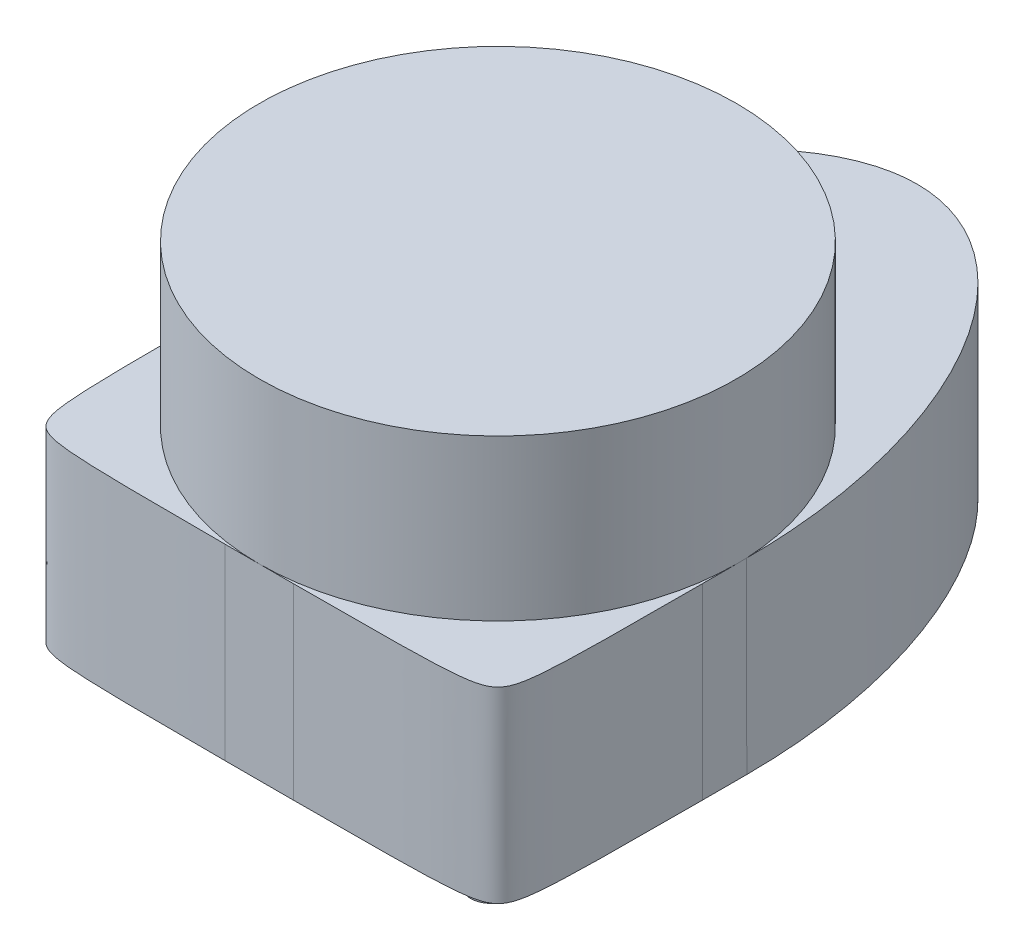
ISO-10303-21;
HEADER;
FILE_DESCRIPTION(('STEP AP214'),'2;1');
FILE_NAME('part.step','',(''),(''),'','','');
FILE_SCHEMA(('AUTOMOTIVE_DESIGN { 1 0 10303 214 1 1 1 1 }'));
ENDSEC;
DATA;
#1=APPLICATION_CONTEXT('core data for automotive mechanical design processes');
#2=APPLICATION_PROTOCOL_DEFINITION('international standard','automotive_design',2000,#1);
#3=PRODUCT_CONTEXT('',#1,'mechanical');
#4=PRODUCT('Part','Part','',(#3));
#5=PRODUCT_RELATED_PRODUCT_CATEGORY('part','',(#4));
#6=PRODUCT_DEFINITION_FORMATION('','',#4);
#7=PRODUCT_DEFINITION_CONTEXT('part definition',#1,'design');
#8=PRODUCT_DEFINITION('design','',#6,#7);
#9=PRODUCT_DEFINITION_SHAPE('','',#8);
#10=(LENGTH_UNIT() NAMED_UNIT(*) SI_UNIT(.MILLI.,.METRE.));
#11=(NAMED_UNIT(*) PLANE_ANGLE_UNIT() SI_UNIT($,.RADIAN.));
#12=(NAMED_UNIT(*) SI_UNIT($,.STERADIAN.) SOLID_ANGLE_UNIT());
#13=UNCERTAINTY_MEASURE_WITH_UNIT(LENGTH_MEASURE(1.E-05),#10,'distance_accuracy_value','');
#14=(GEOMETRIC_REPRESENTATION_CONTEXT(3) GLOBAL_UNCERTAINTY_ASSIGNED_CONTEXT((#13)) GLOBAL_UNIT_ASSIGNED_CONTEXT((#10,
#11,#12)) REPRESENTATION_CONTEXT('',''));
#15=CARTESIAN_POINT('',(0.,0.,0.));
#16=DIRECTION('',(0.,0.,1.));
#17=DIRECTION('',(1.,0.,0.));
#18=AXIS2_PLACEMENT_3D('',#15,#16,#17);
#19=CARTESIAN_POINT('',(35.,2.75,5.00000000000001));
#20=CARTESIAN_POINT('',(35.,-8.25000000000002,5.00000000000001));
#21=CARTESIAN_POINT('',(35.,-19.25,5.00000000000001));
#22=CARTESIAN_POINT('',(35.,-30.25,5.00000000000001));
#23=CARTESIAN_POINT('',(35.,2.75,35.));
#24=CARTESIAN_POINT('',(35.,-8.25,35.));
#25=CARTESIAN_POINT('',(35.,-19.25,35.));
#26=CARTESIAN_POINT('',(35.,-30.25,35.));
#27=CARTESIAN_POINT('',(5.00000000000001,2.75,35.));
#28=CARTESIAN_POINT('',(5.00000000000001,-8.25000000000002,35.));
#29=CARTESIAN_POINT('',(5.00000000000001,-19.25,35.));
#30=CARTESIAN_POINT('',(5.00000000000001,-30.25,35.));
#31=(BOUNDED_SURFACE() B_SPLINE_SURFACE(2,3,((#19,#20,#21,#22),(#23,#24,#25,#26),(#27,#28,#29,
#30)),.UNSPECIFIED.,.F.,.F.,.F.) B_SPLINE_SURFACE_WITH_KNOTS((3,3),(4,4),(0.,1.),(-0.03025,
0.00275),.UNSPECIFIED.) GEOMETRIC_REPRESENTATION_ITEM() RATIONAL_B_SPLINE_SURFACE(((1.,1.,1.,
1.),(7.07106781186548,7.07106781186548,7.07106781186548,7.07106781186548),(1.,1.,1.,1.))) REPRESENTATION_ITEM('') SURFACE());
#32=CARTESIAN_POINT('',(35.,-30.25,5.00000000000001));
#33=CARTESIAN_POINT('',(35.,-19.25,5.00000000000001));
#34=CARTESIAN_POINT('',(35.,-8.25000000000002,5.00000000000001));
#35=CARTESIAN_POINT('',(35.,2.75,5.00000000000001));
#36=(BOUNDED_CURVE() B_SPLINE_CURVE(3,(#32,#33,#34,#35),.UNSPECIFIED.,.F.,
.F.) B_SPLINE_CURVE_WITH_KNOTS((4,4),(-0.03025,0.00275),
.UNSPECIFIED.) CURVE() GEOMETRIC_REPRESENTATION_ITEM() RATIONAL_B_SPLINE_CURVE((1.,1.,1.,1.)) REPRESENTATION_ITEM(''));
#37=CARTESIAN_POINT('',(35.,0.,5.00000000000001));
#38=VERTEX_POINT('',#37);
#39=CARTESIAN_POINT('',(35.,-27.5,5.00000000000001));
#40=VERTEX_POINT('',#39);
#41=EDGE_CURVE('E488',#38,#40,#36,.F.);
#42=CARTESIAN_POINT('',(35.,0.,5.00000000000001));
#43=CARTESIAN_POINT('',(35.,0.,35.));
#44=CARTESIAN_POINT('',(5.00000000000001,0.,35.));
#45=(BOUNDED_CURVE() B_SPLINE_CURVE(2,(#42,#43,#44),.UNSPECIFIED.,.F.,
.F.) B_SPLINE_CURVE_WITH_KNOTS((3,3),(0.,1.),
.UNSPECIFIED.) CURVE() GEOMETRIC_REPRESENTATION_ITEM() RATIONAL_B_SPLINE_CURVE((1.,
7.07106781186548,1.)) REPRESENTATION_ITEM(''));
#46=CARTESIAN_POINT('',(5.00000000000001,0.,35.));
#47=VERTEX_POINT('',#46);
#48=EDGE_CURVE('E51',#47,#38,#45,.F.);
#49=CARTESIAN_POINT('',(5.00000000000001,2.75,35.));
#50=CARTESIAN_POINT('',(5.00000000000001,-8.25000000000002,35.));
#51=CARTESIAN_POINT('',(5.00000000000001,-19.25,35.));
#52=CARTESIAN_POINT('',(5.00000000000001,-30.25,35.));
#53=(BOUNDED_CURVE() B_SPLINE_CURVE(3,(#49,#50,#51,#52),.UNSPECIFIED.,.F.,
.F.) B_SPLINE_CURVE_WITH_KNOTS((4,4),(-0.03025,0.00275),
.UNSPECIFIED.) CURVE() GEOMETRIC_REPRESENTATION_ITEM() RATIONAL_B_SPLINE_CURVE((1.,1.,1.,1.)) REPRESENTATION_ITEM(''));
#54=CARTESIAN_POINT('',(5.00000000000001,-27.5,35.));
#55=VERTEX_POINT('',#54);
#56=EDGE_CURVE('E494',#55,#47,#53,.F.);
#57=CARTESIAN_POINT('',(5.00000000000001,-27.5,35.));
#58=CARTESIAN_POINT('',(35.,-27.5,35.));
#59=CARTESIAN_POINT('',(35.,-27.5,5.00000000000001));
#60=(BOUNDED_CURVE() B_SPLINE_CURVE(2,(#57,#58,#59),.UNSPECIFIED.,.F.,
.F.) B_SPLINE_CURVE_WITH_KNOTS((3,3),(0.,1.),
.UNSPECIFIED.) CURVE() GEOMETRIC_REPRESENTATION_ITEM() RATIONAL_B_SPLINE_CURVE((1.,
7.07106781186548,1.)) REPRESENTATION_ITEM(''));
#61=EDGE_CURVE('E12',#40,#55,#60,.F.);
#62=ORIENTED_EDGE('',*,*,#41,.F.);
#63=ORIENTED_EDGE('',*,*,#48,.F.);
#64=ORIENTED_EDGE('',*,*,#56,.F.);
#65=ORIENTED_EDGE('',*,*,#61,.F.);
#66=EDGE_LOOP('',(#62,#63,#64,#65));
#67=FACE_BOUND('',#66,.T.);
#68=ADVANCED_FACE('F38',(#67),#31,.T.);
#69=CARTESIAN_POINT('',(-35.,-30.25,5.));
#70=CARTESIAN_POINT('',(-35.,-19.25,5.));
#71=CARTESIAN_POINT('',(-35.,-8.25000000000001,5.));
#72=CARTESIAN_POINT('',(-35.,2.75,5.));
#73=CARTESIAN_POINT('',(-35.,-30.25,35.));
#74=CARTESIAN_POINT('',(-35.,-19.25,35.));
#75=CARTESIAN_POINT('',(-35.,-8.25000000000001,35.));
#76=CARTESIAN_POINT('',(-35.,2.75,35.));
#77=CARTESIAN_POINT('',(-5.,-30.25,35.));
#78=CARTESIAN_POINT('',(-5.,-19.25,35.));
#79=CARTESIAN_POINT('',(-5.,-8.25000000000001,35.));
#80=CARTESIAN_POINT('',(-5.,2.75,35.));
#81=(BOUNDED_SURFACE() B_SPLINE_SURFACE(2,3,((#69,#70,#71,#72),(#73,#74,#75,#76),(#77,#78,#79,
#80)),.UNSPECIFIED.,.F.,.F.,.F.) B_SPLINE_SURFACE_WITH_KNOTS((3,3),(4,4),(0.,1.),(-0.00275,
0.03025),.UNSPECIFIED.) GEOMETRIC_REPRESENTATION_ITEM() RATIONAL_B_SPLINE_SURFACE(((1.,1.,1.,
1.),(7.07106781186547,7.07106781186547,7.07106781186547,7.07106781186547),(1.,1.,1.,1.))) REPRESENTATION_ITEM('') SURFACE());
#82=CARTESIAN_POINT('',(-35.,2.75,5.));
#83=CARTESIAN_POINT('',(-35.,-8.25000000000001,5.));
#84=CARTESIAN_POINT('',(-35.,-19.25,5.));
#85=CARTESIAN_POINT('',(-35.,-30.25,5.));
#86=(BOUNDED_CURVE() B_SPLINE_CURVE(3,(#82,#83,#84,#85),.UNSPECIFIED.,.F.,
.F.) B_SPLINE_CURVE_WITH_KNOTS((4,4),(-0.00275,0.03025),
.UNSPECIFIED.) CURVE() GEOMETRIC_REPRESENTATION_ITEM() RATIONAL_B_SPLINE_CURVE((1.,1.,1.,1.)) REPRESENTATION_ITEM(''));
#87=CARTESIAN_POINT('',(-35.,-27.5,5.));
#88=VERTEX_POINT('',#87);
#89=CARTESIAN_POINT('',(-35.,0.,5.));
#90=VERTEX_POINT('',#89);
#91=EDGE_CURVE('E120',#88,#90,#86,.F.);
#92=CARTESIAN_POINT('',(-35.,-27.5,5.));
#93=CARTESIAN_POINT('',(-35.,-27.5,35.));
#94=CARTESIAN_POINT('',(-5.,-27.5,35.));
#95=(BOUNDED_CURVE() B_SPLINE_CURVE(2,(#92,#93,#94),.UNSPECIFIED.,.F.,
.F.) B_SPLINE_CURVE_WITH_KNOTS((3,3),(0.,1.),
.UNSPECIFIED.) CURVE() GEOMETRIC_REPRESENTATION_ITEM() RATIONAL_B_SPLINE_CURVE((1.,
7.07106781186547,1.)) REPRESENTATION_ITEM(''));
#96=CARTESIAN_POINT('',(-5.,-27.5,35.));
#97=VERTEX_POINT('',#96);
#98=EDGE_CURVE('E573',#97,#88,#95,.F.);
#99=CARTESIAN_POINT('',(-5.,-30.25,35.));
#100=CARTESIAN_POINT('',(-5.,-19.25,35.));
#101=CARTESIAN_POINT('',(-5.,-8.25000000000001,35.));
#102=CARTESIAN_POINT('',(-5.,2.75,35.));
#103=(BOUNDED_CURVE() B_SPLINE_CURVE(3,(#99,#100,#101,#102),.UNSPECIFIED.,.F.,
.F.) B_SPLINE_CURVE_WITH_KNOTS((4,4),(-0.00275,0.03025),
.UNSPECIFIED.) CURVE() GEOMETRIC_REPRESENTATION_ITEM() RATIONAL_B_SPLINE_CURVE((1.,1.,1.,1.)) REPRESENTATION_ITEM(''));
#104=CARTESIAN_POINT('',(-5.,0.,35.));
#105=VERTEX_POINT('',#104);
#106=EDGE_CURVE('E576',#105,#97,#103,.F.);
#107=CARTESIAN_POINT('',(-5.,0.,35.));
#108=CARTESIAN_POINT('',(-35.,0.,35.));
#109=CARTESIAN_POINT('',(-35.,0.,5.));
#110=(BOUNDED_CURVE() B_SPLINE_CURVE(2,(#107,#108,#109),.UNSPECIFIED.,.F.,
.F.) B_SPLINE_CURVE_WITH_KNOTS((3,3),(0.,1.),
.UNSPECIFIED.) CURVE() GEOMETRIC_REPRESENTATION_ITEM() RATIONAL_B_SPLINE_CURVE((1.,
7.07106781186548,1.)) REPRESENTATION_ITEM(''));
#111=EDGE_CURVE('E248',#90,#105,#110,.F.);
#112=ORIENTED_EDGE('',*,*,#91,.F.);
#113=ORIENTED_EDGE('',*,*,#98,.F.);
#114=ORIENTED_EDGE('',*,*,#106,.F.);
#115=ORIENTED_EDGE('',*,*,#111,.F.);
#116=EDGE_LOOP('',(#112,#113,#114,#115));
#117=FACE_BOUND('',#116,.T.);
#118=ADVANCED_FACE('F266',(#117),#81,.T.);
#119=CARTESIAN_POINT('',(0.,0.,0.));
#120=DIRECTION('',(0.,-1.,0.));
#121=DIRECTION('',(0.,0.,-1.));
#122=AXIS2_PLACEMENT_3D('',#119,#120,#121);
#123=PLANE('',#122);
#124=DIRECTION('',(0.,0.,1.));
#125=VECTOR('',#124,1.);
#126=CARTESIAN_POINT('',(35.,0.,35.));
#127=LINE('',#126,#125);
#128=CARTESIAN_POINT('',(34.9839506768092,0.,-1.49931217186325));
#129=VERTEX_POINT('',#128);
#130=CARTESIAN_POINT('',(35.,0.,0.));
#131=VERTEX_POINT('',#130);
#132=EDGE_CURVE('E414',#129,#131,#127,.T.);
#133=ORIENTED_EDGE('',*,*,#132,.F.);
#134=CARTESIAN_POINT('',(0.,0.,0.));
#135=DIRECTION('',(0.,1.,0.));
#136=DIRECTION('',(0.,0.,1.));
#137=AXIS2_PLACEMENT_3D('',#134,#135,#136);
#138=CIRCLE('',#137,35.);
#139=EDGE_CURVE('E156',#131,#129,#138,.T.);
#140=ORIENTED_EDGE('',*,*,#139,.F.);
#141=EDGE_LOOP('',(#133,#140));
#142=FACE_BOUND('',#141,.T.);
#143=ADVANCED_FACE('F280',(#142),#123,.F.);
#144=CARTESIAN_POINT('',(-34.9839506768092,0.,-1.49931217186326));
#145=VERTEX_POINT('',#144);
#146=CARTESIAN_POINT('',(-35.,0.,0.));
#147=VERTEX_POINT('',#146);
#148=EDGE_CURVE('E129',#145,#147,#138,.T.);
#149=ORIENTED_EDGE('',*,*,#148,.F.);
#150=DIRECTION('',(0.,0.,-1.));
#151=VECTOR('',#150,1.);
#152=CARTESIAN_POINT('',(-35.,0.,35.));
#153=LINE('',#152,#151);
#154=EDGE_CURVE('E117',#147,#145,#153,.T.);
#155=ORIENTED_EDGE('',*,*,#154,.F.);
#156=EDGE_LOOP('',(#149,#155));
#157=FACE_BOUND('',#156,.T.);
#158=ADVANCED_FACE('F147',(#157),#123,.F.);
#159=CARTESIAN_POINT('',(0.,23.5,0.));
#160=DIRECTION('',(0.,-1.,0.));
#161=DIRECTION('',(0.,0.,-1.));
#162=AXIS2_PLACEMENT_3D('',#159,#160,#161);
#163=CYLINDRICAL_SURFACE('',#162,35.);
#164=CARTESIAN_POINT('',(0.,23.5,0.));
#165=DIRECTION('',(0.,1.,0.));
#166=DIRECTION('',(0.,0.,1.));
#167=AXIS2_PLACEMENT_3D('',#164,#165,#166);
#168=CIRCLE('',#167,35.);
#169=CARTESIAN_POINT('',(0.,23.5,35.));
#170=VERTEX_POINT('',#169);
#171=EDGE_CURVE('E515',#170,#170,#168,.T.);
#172=ORIENTED_EDGE('',*,*,#171,.F.);
#173=EDGE_LOOP('',(#172));
#174=FACE_BOUND('',#173,.T.);
#175=CARTESIAN_POINT('',(0.,0.,35.));
#176=VERTEX_POINT('',#175);
#177=EDGE_CURVE('E146',#176,#131,#138,.T.);
#178=ORIENTED_EDGE('',*,*,#177,.T.);
#179=ORIENTED_EDGE('',*,*,#139,.T.);
#180=EDGE_CURVE('E135',#129,#145,#138,.T.);
#181=ORIENTED_EDGE('',*,*,#180,.T.);
#182=ORIENTED_EDGE('',*,*,#148,.T.);
#183=EDGE_CURVE('E132',#147,#176,#138,.T.);
#184=ORIENTED_EDGE('',*,*,#183,.T.);
#185=EDGE_LOOP('',(#178,#179,#181,#182,#184));
#186=FACE_BOUND('',#185,.T.);
#187=ADVANCED_FACE('F131',(#174,#186),#163,.T.);
#188=CARTESIAN_POINT('',(0.,23.5,0.));
#189=DIRECTION('',(0.,1.,0.));
#190=DIRECTION('',(0.,0.,1.));
#191=AXIS2_PLACEMENT_3D('',#188,#189,#190);
#192=PLANE('',#191);
#193=ORIENTED_EDGE('',*,*,#171,.T.);
#194=EDGE_LOOP('',(#193));
#195=FACE_BOUND('',#194,.T.);
#196=ADVANCED_FACE('F189',(#195),#192,.T.);
#197=DIRECTION('',(-1.,0.,0.));
#198=VECTOR('',#197,1.);
#199=CARTESIAN_POINT('',(-35.,0.,35.));
#200=LINE('',#199,#198);
#201=EDGE_CURVE('E510',#47,#176,#200,.T.);
#202=ORIENTED_EDGE('',*,*,#201,.F.);
#203=ORIENTED_EDGE('',*,*,#48,.T.);
#204=EDGE_CURVE('E124',#131,#38,#127,.T.);
#205=ORIENTED_EDGE('',*,*,#204,.F.);
#206=ORIENTED_EDGE('',*,*,#177,.F.);
#207=EDGE_LOOP('',(#202,#203,#205,#206));
#208=FACE_BOUND('',#207,.T.);
#209=ADVANCED_FACE('F612',(#208),#123,.F.);
#210=ORIENTED_EDGE('',*,*,#180,.F.);
#211=CARTESIAN_POINT('',(0.,0.,-61.5));
#212=CARTESIAN_POINT('',(35.,0.,-61.5));
#213=CARTESIAN_POINT('',(35.,0.,-1.5));
#214=(BOUNDED_CURVE() B_SPLINE_CURVE(2,(#211,#212,#213),.UNSPECIFIED.,.F.,
.F.) B_SPLINE_CURVE_WITH_KNOTS((3,3),(0.,1.),
.UNSPECIFIED.) CURVE() GEOMETRIC_REPRESENTATION_ITEM() RATIONAL_B_SPLINE_CURVE((1.,
0.666666666666667,1.)) REPRESENTATION_ITEM(''));
#215=CARTESIAN_POINT('',(0.,0.,-61.5));
#216=VERTEX_POINT('',#215);
#217=EDGE_CURVE('E528',#129,#216,#214,.F.);
#218=ORIENTED_EDGE('',*,*,#217,.T.);
#219=CARTESIAN_POINT('',(-35.,0.,-1.5));
#220=CARTESIAN_POINT('',(-35.,0.,-61.5));
#221=CARTESIAN_POINT('',(0.,0.,-61.5));
#222=(BOUNDED_CURVE() B_SPLINE_CURVE(2,(#219,#220,#221),.UNSPECIFIED.,.F.,
.F.) B_SPLINE_CURVE_WITH_KNOTS((3,3),(0.,1.),
.UNSPECIFIED.) CURVE() GEOMETRIC_REPRESENTATION_ITEM() RATIONAL_B_SPLINE_CURVE((1.,
0.666666666666667,1.)) REPRESENTATION_ITEM(''));
#223=EDGE_CURVE('E571',#216,#145,#222,.F.);
#224=ORIENTED_EDGE('',*,*,#223,.T.);
#225=EDGE_LOOP('',(#210,#218,#224));
#226=FACE_BOUND('',#225,.T.);
#227=ADVANCED_FACE('F186',(#226),#123,.F.);
#228=CARTESIAN_POINT('',(-35.,-27.5,35.));
#229=DIRECTION('',(1.,0.,0.));
#230=DIRECTION('',(0.,0.,-1.));
#231=AXIS2_PLACEMENT_3D('',#228,#229,#230);
#232=PLANE('',#231);
#233=DIRECTION('',(0.,0.,-1.));
#234=VECTOR('',#233,1.);
#235=CARTESIAN_POINT('',(-35.,-27.5,35.));
#236=LINE('',#235,#234);
#237=CARTESIAN_POINT('',(-35.,-27.5,-1.5));
#238=VERTEX_POINT('',#237);
#239=EDGE_CURVE('E167',#88,#238,#236,.T.);
#240=ORIENTED_EDGE('',*,*,#239,.F.);
#241=ORIENTED_EDGE('',*,*,#91,.T.);
#242=EDGE_CURVE('E111',#90,#147,#153,.T.);
#243=ORIENTED_EDGE('',*,*,#242,.T.);
#244=ORIENTED_EDGE('',*,*,#154,.T.);
#245=CARTESIAN_POINT('',(-35.,-28.875,-1.5));
#246=CARTESIAN_POINT('',(-35.,-18.7916666666667,-1.5));
#247=CARTESIAN_POINT('',(-35.,-8.70833333333334,-1.5));
#248=CARTESIAN_POINT('',(-35.,1.375,-1.5));
#249=(BOUNDED_CURVE() B_SPLINE_CURVE(3,(#245,#246,#247,#248),.UNSPECIFIED.,.F.,
.F.) B_SPLINE_CURVE_WITH_KNOTS((4,4),(-0.001375,0.028875),
.UNSPECIFIED.) CURVE() GEOMETRIC_REPRESENTATION_ITEM() RATIONAL_B_SPLINE_CURVE((1.,1.,1.,1.)) REPRESENTATION_ITEM(''));
#250=EDGE_CURVE('E572',#145,#238,#249,.F.);
#251=ORIENTED_EDGE('',*,*,#250,.T.);
#252=EDGE_LOOP('',(#240,#241,#243,#244,#251));
#253=FACE_BOUND('',#252,.T.);
#254=ADVANCED_FACE('F114',(#253),#232,.F.);
#255=CARTESIAN_POINT('',(35.,-27.5,35.));
#256=DIRECTION('',(-1.,0.,0.));
#257=DIRECTION('',(0.,0.,1.));
#258=AXIS2_PLACEMENT_3D('',#255,#256,#257);
#259=PLANE('',#258);
#260=ORIENTED_EDGE('',*,*,#204,.T.);
#261=ORIENTED_EDGE('',*,*,#41,.T.);
#262=DIRECTION('',(0.,0.,1.));
#263=VECTOR('',#262,1.);
#264=CARTESIAN_POINT('',(35.,-27.5,35.));
#265=LINE('',#264,#263);
#266=CARTESIAN_POINT('',(35.,-27.5,-1.49999999999999));
#267=VERTEX_POINT('',#266);
#268=EDGE_CURVE('E421',#267,#40,#265,.T.);
#269=ORIENTED_EDGE('',*,*,#268,.F.);
#270=CARTESIAN_POINT('',(35.,1.375,-1.5));
#271=CARTESIAN_POINT('',(35.,-8.70833333333334,-1.5));
#272=CARTESIAN_POINT('',(35.,-18.7916666666667,-1.5));
#273=CARTESIAN_POINT('',(35.,-28.875,-1.5));
#274=(BOUNDED_CURVE() B_SPLINE_CURVE(3,(#270,#271,#272,#273),.UNSPECIFIED.,.F.,
.F.) B_SPLINE_CURVE_WITH_KNOTS((4,4),(-0.001375,0.028875),
.UNSPECIFIED.) CURVE() GEOMETRIC_REPRESENTATION_ITEM() RATIONAL_B_SPLINE_CURVE((1.,1.,1.,1.)) REPRESENTATION_ITEM(''));
#275=EDGE_CURVE('E542',#267,#129,#274,.F.);
#276=ORIENTED_EDGE('',*,*,#275,.T.);
#277=ORIENTED_EDGE('',*,*,#132,.T.);
#278=EDGE_LOOP('',(#260,#261,#269,#276,#277));
#279=FACE_BOUND('',#278,.T.);
#280=ADVANCED_FACE('F185',(#279),#259,.F.);
#281=CARTESIAN_POINT('',(-35.,-27.5,35.));
#282=DIRECTION('',(0.,0.,-1.));
#283=DIRECTION('',(-1.,0.,0.));
#284=AXIS2_PLACEMENT_3D('',#281,#282,#283);
#285=PLANE('',#284);
#286=DIRECTION('',(-1.,0.,0.));
#287=VECTOR('',#286,1.);
#288=CARTESIAN_POINT('',(-35.,-27.5,35.));
#289=LINE('',#288,#287);
#290=EDGE_CURVE('E144',#55,#97,#289,.T.);
#291=ORIENTED_EDGE('',*,*,#290,.F.);
#292=ORIENTED_EDGE('',*,*,#56,.T.);
#293=ORIENTED_EDGE('',*,*,#201,.T.);
#294=EDGE_CURVE('E142',#176,#105,#200,.T.);
#295=ORIENTED_EDGE('',*,*,#294,.T.);
#296=ORIENTED_EDGE('',*,*,#106,.T.);
#297=EDGE_LOOP('',(#291,#292,#293,#295,#296));
#298=FACE_BOUND('',#297,.T.);
#299=ADVANCED_FACE('F222',(#298),#285,.F.);
#300=CARTESIAN_POINT('',(0.,-27.5,0.));
#301=DIRECTION('',(0.,-1.,0.));
#302=DIRECTION('',(0.,0.,-1.));
#303=AXIS2_PLACEMENT_3D('',#300,#301,#302);
#304=PLANE('',#303);
#305=CARTESIAN_POINT('',(-19.,-27.5,-42.5));
#306=DIRECTION('',(0.,-1.,0.));
#307=DIRECTION('',(0.,0.,-1.));
#308=AXIS2_PLACEMENT_3D('',#305,#306,#307);
#309=CIRCLE('',#308,3.);
#310=CARTESIAN_POINT('',(-19.,-27.5,-45.5));
#311=VERTEX_POINT('',#310);
#312=EDGE_CURVE('E443',#311,#311,#309,.T.);
#313=ORIENTED_EDGE('',*,*,#312,.F.);
#314=EDGE_LOOP('',(#313));
#315=FACE_BOUND('',#314,.T.);
#316=CARTESIAN_POINT('',(19.,-27.5,-42.5));
#317=DIRECTION('',(0.,-1.,0.));
#318=DIRECTION('',(0.,0.,-1.));
#319=AXIS2_PLACEMENT_3D('',#316,#317,#318);
#320=CIRCLE('',#319,3.);
#321=CARTESIAN_POINT('',(19.,-27.5,-45.5));
#322=VERTEX_POINT('',#321);
#323=EDGE_CURVE('E437',#322,#322,#320,.T.);
#324=ORIENTED_EDGE('',*,*,#323,.F.);
#325=EDGE_LOOP('',(#324));
#326=FACE_BOUND('',#325,.T.);
#327=CARTESIAN_POINT('',(27.,-27.5,28.));
#328=DIRECTION('',(0.,-1.,0.));
#329=DIRECTION('',(0.,0.,-1.));
#330=AXIS2_PLACEMENT_3D('',#327,#328,#329);
#331=CIRCLE('',#330,2.99999999999999);
#332=CARTESIAN_POINT('',(27.,-27.5,25.));
#333=VERTEX_POINT('',#332);
#334=EDGE_CURVE('E431',#333,#333,#331,.T.);
#335=ORIENTED_EDGE('',*,*,#334,.F.);
#336=EDGE_LOOP('',(#335));
#337=FACE_BOUND('',#336,.T.);
#338=CARTESIAN_POINT('',(-27.,-27.5,28.));
#339=DIRECTION('',(0.,-1.,0.));
#340=DIRECTION('',(0.,0.,-1.));
#341=AXIS2_PLACEMENT_3D('',#338,#339,#340);
#342=CIRCLE('',#341,2.99999999999999);
#343=CARTESIAN_POINT('',(-27.,-27.5,25.));
#344=VERTEX_POINT('',#343);
#345=EDGE_CURVE('E151',#344,#344,#342,.T.);
#346=ORIENTED_EDGE('',*,*,#345,.F.);
#347=EDGE_LOOP('',(#346));
#348=FACE_BOUND('',#347,.T.);
#349=ORIENTED_EDGE('',*,*,#268,.T.);
#350=ORIENTED_EDGE('',*,*,#61,.T.);
#351=ORIENTED_EDGE('',*,*,#290,.T.);
#352=ORIENTED_EDGE('',*,*,#98,.T.);
#353=ORIENTED_EDGE('',*,*,#239,.T.);
#354=CARTESIAN_POINT('',(0.,-27.5,-61.5));
#355=CARTESIAN_POINT('',(-35.,-27.5,-61.5));
#356=CARTESIAN_POINT('',(-35.,-27.5,-1.5));
#357=(BOUNDED_CURVE() B_SPLINE_CURVE(2,(#354,#355,#356),.UNSPECIFIED.,.F.,
.F.) B_SPLINE_CURVE_WITH_KNOTS((3,3),(0.,1.),
.UNSPECIFIED.) CURVE() GEOMETRIC_REPRESENTATION_ITEM() RATIONAL_B_SPLINE_CURVE((1.,
0.666666666666666,1.)) REPRESENTATION_ITEM(''));
#358=CARTESIAN_POINT('',(0.,-27.5,-61.5));
#359=VERTEX_POINT('',#358);
#360=EDGE_CURVE('E204',#238,#359,#357,.F.);
#361=ORIENTED_EDGE('',*,*,#360,.T.);
#362=CARTESIAN_POINT('',(35.,-27.5,-1.5));
#363=CARTESIAN_POINT('',(35.,-27.5,-61.5));
#364=CARTESIAN_POINT('',(0.,-27.5,-61.5));
#365=(BOUNDED_CURVE() B_SPLINE_CURVE(2,(#362,#363,#364),.UNSPECIFIED.,.F.,
.F.) B_SPLINE_CURVE_WITH_KNOTS((3,3),(0.,1.),
.UNSPECIFIED.) CURVE() GEOMETRIC_REPRESENTATION_ITEM() RATIONAL_B_SPLINE_CURVE((1.,
0.666666666666667,1.)) REPRESENTATION_ITEM(''));
#366=EDGE_CURVE('E537',#359,#267,#365,.F.);
#367=ORIENTED_EDGE('',*,*,#366,.T.);
#368=EDGE_LOOP('',(#349,#350,#351,#352,#353,#361,#367));
#369=FACE_BOUND('',#368,.T.);
#370=ADVANCED_FACE('F212',(#315,#326,#337,#348,#369),#304,.T.);
#371=ORIENTED_EDGE('',*,*,#242,.F.);
#372=ORIENTED_EDGE('',*,*,#111,.T.);
#373=ORIENTED_EDGE('',*,*,#294,.F.);
#374=ORIENTED_EDGE('',*,*,#183,.F.);
#375=EDGE_LOOP('',(#371,#372,#373,#374));
#376=FACE_BOUND('',#375,.T.);
#377=ADVANCED_FACE('F140',(#376),#123,.F.);
#378=CARTESIAN_POINT('',(0.,-28.875,-61.5));
#379=CARTESIAN_POINT('',(0.,-18.7916666666667,-61.5));
#380=CARTESIAN_POINT('',(0.,-8.70833333333334,-61.5));
#381=CARTESIAN_POINT('',(0.,1.375,-61.5));
#382=CARTESIAN_POINT('',(-35.,-28.875,-61.5));
#383=CARTESIAN_POINT('',(-35.,-18.7916666666667,-61.5));
#384=CARTESIAN_POINT('',(-35.,-8.70833333333334,-61.5));
#385=CARTESIAN_POINT('',(-35.,1.375,-61.5));
#386=CARTESIAN_POINT('',(-35.,-28.875,-1.5));
#387=CARTESIAN_POINT('',(-35.,-18.7916666666667,-1.5));
#388=CARTESIAN_POINT('',(-35.,-8.70833333333334,-1.5));
#389=CARTESIAN_POINT('',(-35.,1.375,-1.5));
#390=(BOUNDED_SURFACE() B_SPLINE_SURFACE(2,3,((#378,#379,#380,#381),(#382,#383,#384,#385),(#386,
#387,#388,#389)),.UNSPECIFIED.,.F.,.F.,.F.) B_SPLINE_SURFACE_WITH_KNOTS((3,3),(4,4),(0.,1.),
(-0.001375,0.028875),
.UNSPECIFIED.) GEOMETRIC_REPRESENTATION_ITEM() RATIONAL_B_SPLINE_SURFACE(((1.,1.,1.,1.),
(0.666666666666667,0.666666666666667,0.666666666666667,0.666666666666667),(1.,1.,1.,1.))) REPRESENTATION_ITEM('') SURFACE());
#391=CARTESIAN_POINT('',(0.,-28.875,-61.5));
#392=CARTESIAN_POINT('',(0.,-18.7916666666667,-61.5));
#393=CARTESIAN_POINT('',(0.,-8.70833333333334,-61.5));
#394=CARTESIAN_POINT('',(0.,1.375,-61.5));
#395=(BOUNDED_CURVE() B_SPLINE_CURVE(3,(#391,#392,#393,#394),.UNSPECIFIED.,.F.,
.F.) B_SPLINE_CURVE_WITH_KNOTS((4,4),(-0.001375,0.028875),
.UNSPECIFIED.) CURVE() GEOMETRIC_REPRESENTATION_ITEM() RATIONAL_B_SPLINE_CURVE((1.,1.,1.,1.)) REPRESENTATION_ITEM(''));
#396=EDGE_CURVE('E518',#359,#216,#395,.T.);
#397=ORIENTED_EDGE('',*,*,#360,.F.);
#398=ORIENTED_EDGE('',*,*,#250,.F.);
#399=ORIENTED_EDGE('',*,*,#223,.F.);
#400=ORIENTED_EDGE('',*,*,#396,.F.);
#401=EDGE_LOOP('',(#397,#398,#399,#400));
#402=FACE_BOUND('',#401,.T.);
#403=ADVANCED_FACE('F369',(#402),#390,.T.);
#404=CARTESIAN_POINT('',(35.,-28.875,-1.5));
#405=CARTESIAN_POINT('',(35.,-18.7916666666667,-1.5));
#406=CARTESIAN_POINT('',(35.,-8.70833333333334,-1.5));
#407=CARTESIAN_POINT('',(35.,1.375,-1.5));
#408=CARTESIAN_POINT('',(35.,-28.875,-61.5));
#409=CARTESIAN_POINT('',(35.,-18.7916666666667,-61.5));
#410=CARTESIAN_POINT('',(35.,-8.70833333333334,-61.5));
#411=CARTESIAN_POINT('',(35.,1.375,-61.5));
#412=CARTESIAN_POINT('',(0.,-28.875,-61.5));
#413=CARTESIAN_POINT('',(0.,-18.7916666666667,-61.5));
#414=CARTESIAN_POINT('',(0.,-8.70833333333334,-61.5));
#415=CARTESIAN_POINT('',(0.,1.375,-61.5));
#416=(BOUNDED_SURFACE() B_SPLINE_SURFACE(2,3,((#404,#405,#406,#407),(#408,#409,#410,#411),(#412,
#413,#414,#415)),.UNSPECIFIED.,.F.,.F.,.F.) B_SPLINE_SURFACE_WITH_KNOTS((3,3),(4,4),(0.,1.),
(-0.001375,0.028875),
.UNSPECIFIED.) GEOMETRIC_REPRESENTATION_ITEM() RATIONAL_B_SPLINE_SURFACE(((1.,1.,1.,1.),
(0.666666666666667,0.666666666666667,0.666666666666667,0.666666666666667),(1.,1.,1.,1.))) REPRESENTATION_ITEM('') SURFACE());
#417=ORIENTED_EDGE('',*,*,#366,.F.);
#418=ORIENTED_EDGE('',*,*,#396,.T.);
#419=ORIENTED_EDGE('',*,*,#217,.F.);
#420=ORIENTED_EDGE('',*,*,#275,.F.);
#421=EDGE_LOOP('',(#417,#418,#419,#420));
#422=FACE_BOUND('',#421,.T.);
#423=ADVANCED_FACE('F281',(#422),#416,.T.);
#424=CARTESIAN_POINT('',(-27.,-31.,28.));
#425=DIRECTION('',(0.,1.,0.));
#426=DIRECTION('',(0.,0.,1.));
#427=AXIS2_PLACEMENT_3D('',#424,#425,#426);
#428=CYLINDRICAL_SURFACE('',#427,2.99999999999999);
#429=CARTESIAN_POINT('',(-27.,-31.,28.));
#430=DIRECTION('',(0.,-1.,0.));
#431=DIRECTION('',(0.,0.,-1.));
#432=AXIS2_PLACEMENT_3D('',#429,#430,#431);
#433=CIRCLE('',#432,2.99999999999999);
#434=CARTESIAN_POINT('',(-27.,-31.,25.));
#435=VERTEX_POINT('',#434);
#436=EDGE_CURVE('E148',#435,#435,#433,.T.);
#437=ORIENTED_EDGE('',*,*,#436,.F.);
#438=EDGE_LOOP('',(#437));
#439=FACE_BOUND('',#438,.T.);
#440=ORIENTED_EDGE('',*,*,#345,.T.);
#441=EDGE_LOOP('',(#440));
#442=FACE_BOUND('',#441,.T.);
#443=ADVANCED_FACE('F224',(#439,#442),#428,.T.);
#444=CARTESIAN_POINT('',(-27.,-31.,28.));
#445=DIRECTION('',(0.,-1.,0.));
#446=DIRECTION('',(0.,0.,-1.));
#447=AXIS2_PLACEMENT_3D('',#444,#445,#446);
#448=PLANE('',#447);
#449=CARTESIAN_POINT('',(-27.,-31.,28.));
#450=DIRECTION('',(0.,1.,0.));
#451=DIRECTION('',(0.,0.,-1.));
#452=AXIS2_PLACEMENT_3D('',#449,#450,#451);
#453=CIRCLE('',#452,1.);
#454=CARTESIAN_POINT('',(-27.,-31.,27.));
#455=VERTEX_POINT('',#454);
#456=EDGE_CURVE('E461',#455,#455,#453,.T.);
#457=ORIENTED_EDGE('',*,*,#456,.T.);
#458=EDGE_LOOP('',(#457));
#459=FACE_BOUND('',#458,.T.);
#460=ORIENTED_EDGE('',*,*,#436,.T.);
#461=EDGE_LOOP('',(#460));
#462=FACE_BOUND('',#461,.T.);
#463=ADVANCED_FACE('F697',(#459,#462),#448,.T.);
#464=CARTESIAN_POINT('',(27.,-31.,28.));
#465=DIRECTION('',(0.,1.,0.));
#466=DIRECTION('',(0.,0.,1.));
#467=AXIS2_PLACEMENT_3D('',#464,#465,#466);
#468=CYLINDRICAL_SURFACE('',#467,2.99999999999999);
#469=CARTESIAN_POINT('',(27.,-31.,28.));
#470=DIRECTION('',(0.,-1.,0.));
#471=DIRECTION('',(0.,0.,-1.));
#472=AXIS2_PLACEMENT_3D('',#469,#470,#471);
#473=CIRCLE('',#472,2.99999999999999);
#474=CARTESIAN_POINT('',(27.,-31.,25.));
#475=VERTEX_POINT('',#474);
#476=EDGE_CURVE('E429',#475,#475,#473,.T.);
#477=ORIENTED_EDGE('',*,*,#476,.F.);
#478=EDGE_LOOP('',(#477));
#479=FACE_BOUND('',#478,.T.);
#480=ORIENTED_EDGE('',*,*,#334,.T.);
#481=EDGE_LOOP('',(#480));
#482=FACE_BOUND('',#481,.T.);
#483=ADVANCED_FACE('F705',(#479,#482),#468,.T.);
#484=CARTESIAN_POINT('',(27.,-31.,28.));
#485=DIRECTION('',(0.,-1.,0.));
#486=DIRECTION('',(0.,0.,-1.));
#487=AXIS2_PLACEMENT_3D('',#484,#485,#486);
#488=PLANE('',#487);
#489=CARTESIAN_POINT('',(27.,-31.,28.));
#490=DIRECTION('',(0.,-1.,0.));
#491=DIRECTION('',(0.,0.,-1.));
#492=AXIS2_PLACEMENT_3D('',#489,#490,#491);
#493=CIRCLE('',#492,1.);
#494=CARTESIAN_POINT('',(27.,-31.,27.));
#495=VERTEX_POINT('',#494);
#496=EDGE_CURVE('E449',#495,#495,#493,.T.);
#497=ORIENTED_EDGE('',*,*,#496,.F.);
#498=EDGE_LOOP('',(#497));
#499=FACE_BOUND('',#498,.T.);
#500=ORIENTED_EDGE('',*,*,#476,.T.);
#501=EDGE_LOOP('',(#500));
#502=FACE_BOUND('',#501,.T.);
#503=ADVANCED_FACE('F710',(#499,#502),#488,.T.);
#504=CARTESIAN_POINT('',(19.,-31.,-42.5));
#505=DIRECTION('',(0.,1.,0.));
#506=DIRECTION('',(0.,0.,1.));
#507=AXIS2_PLACEMENT_3D('',#504,#505,#506);
#508=CYLINDRICAL_SURFACE('',#507,3.);
#509=CARTESIAN_POINT('',(19.,-31.,-42.5));
#510=DIRECTION('',(0.,-1.,0.));
#511=DIRECTION('',(0.,0.,-1.));
#512=AXIS2_PLACEMENT_3D('',#509,#510,#511);
#513=CIRCLE('',#512,3.);
#514=CARTESIAN_POINT('',(19.,-31.,-45.5));
#515=VERTEX_POINT('',#514);
#516=EDGE_CURVE('E434',#515,#515,#513,.T.);
#517=ORIENTED_EDGE('',*,*,#516,.F.);
#518=EDGE_LOOP('',(#517));
#519=FACE_BOUND('',#518,.T.);
#520=ORIENTED_EDGE('',*,*,#323,.T.);
#521=EDGE_LOOP('',(#520));
#522=FACE_BOUND('',#521,.T.);
#523=ADVANCED_FACE('F718',(#519,#522),#508,.T.);
#524=CARTESIAN_POINT('',(19.,-31.,-42.5));
#525=DIRECTION('',(0.,-1.,0.));
#526=DIRECTION('',(0.,0.,-1.));
#527=AXIS2_PLACEMENT_3D('',#524,#525,#526);
#528=PLANE('',#527);
#529=CARTESIAN_POINT('',(19.,-31.,-42.5));
#530=DIRECTION('',(0.,-1.,0.));
#531=DIRECTION('',(0.,0.,-1.));
#532=AXIS2_PLACEMENT_3D('',#529,#530,#531);
#533=CIRCLE('',#532,1.);
#534=CARTESIAN_POINT('',(19.,-31.,-43.5));
#535=VERTEX_POINT('',#534);
#536=EDGE_CURVE('E455',#535,#535,#533,.T.);
#537=ORIENTED_EDGE('',*,*,#536,.F.);
#538=EDGE_LOOP('',(#537));
#539=FACE_BOUND('',#538,.T.);
#540=ORIENTED_EDGE('',*,*,#516,.T.);
#541=EDGE_LOOP('',(#540));
#542=FACE_BOUND('',#541,.T.);
#543=ADVANCED_FACE('F723',(#539,#542),#528,.T.);
#544=CARTESIAN_POINT('',(-19.,-31.,-42.5));
#545=DIRECTION('',(0.,1.,0.));
#546=DIRECTION('',(0.,0.,1.));
#547=AXIS2_PLACEMENT_3D('',#544,#545,#546);
#548=CYLINDRICAL_SURFACE('',#547,3.);
#549=CARTESIAN_POINT('',(-19.,-31.,-42.5));
#550=DIRECTION('',(0.,-1.,0.));
#551=DIRECTION('',(0.,0.,-1.));
#552=AXIS2_PLACEMENT_3D('',#549,#550,#551);
#553=CIRCLE('',#552,3.);
#554=CARTESIAN_POINT('',(-19.,-31.,-45.5));
#555=VERTEX_POINT('',#554);
#556=EDGE_CURVE('E440',#555,#555,#553,.T.);
#557=ORIENTED_EDGE('',*,*,#556,.F.);
#558=EDGE_LOOP('',(#557));
#559=FACE_BOUND('',#558,.T.);
#560=ORIENTED_EDGE('',*,*,#312,.T.);
#561=EDGE_LOOP('',(#560));
#562=FACE_BOUND('',#561,.T.);
#563=ADVANCED_FACE('F731',(#559,#562),#548,.T.);
#564=CARTESIAN_POINT('',(-19.,-31.,-42.5));
#565=DIRECTION('',(0.,-1.,0.));
#566=DIRECTION('',(0.,0.,-1.));
#567=AXIS2_PLACEMENT_3D('',#564,#565,#566);
#568=PLANE('',#567);
#569=CARTESIAN_POINT('',(-19.,-31.,-42.5));
#570=DIRECTION('',(0.,1.,0.));
#571=DIRECTION('',(0.,0.,-1.));
#572=AXIS2_PLACEMENT_3D('',#569,#570,#571);
#573=CIRCLE('',#572,1.);
#574=CARTESIAN_POINT('',(-19.,-31.,-43.5));
#575=VERTEX_POINT('',#574);
#576=EDGE_CURVE('E467',#575,#575,#573,.T.);
#577=ORIENTED_EDGE('',*,*,#576,.T.);
#578=EDGE_LOOP('',(#577));
#579=FACE_BOUND('',#578,.T.);
#580=ORIENTED_EDGE('',*,*,#556,.T.);
#581=EDGE_LOOP('',(#580));
#582=FACE_BOUND('',#581,.T.);
#583=ADVANCED_FACE('F736',(#579,#582),#568,.T.);
#584=CARTESIAN_POINT('',(27.,-26.,28.));
#585=DIRECTION('',(0.,-1.,0.));
#586=DIRECTION('',(0.,0.,-1.));
#587=AXIS2_PLACEMENT_3D('',#584,#585,#586);
#588=CYLINDRICAL_SURFACE('',#587,1.);
#589=CARTESIAN_POINT('',(27.,-26.,28.));
#590=DIRECTION('',(0.,-1.,0.));
#591=DIRECTION('',(0.,0.,-1.));
#592=AXIS2_PLACEMENT_3D('',#589,#590,#591);
#593=CIRCLE('',#592,1.);
#594=CARTESIAN_POINT('',(27.,-26.,27.));
#595=VERTEX_POINT('',#594);
#596=EDGE_CURVE('E446',#595,#595,#593,.T.);
#597=ORIENTED_EDGE('',*,*,#596,.F.);
#598=EDGE_LOOP('',(#597));
#599=FACE_BOUND('',#598,.T.);
#600=ORIENTED_EDGE('',*,*,#496,.T.);
#601=EDGE_LOOP('',(#600));
#602=FACE_BOUND('',#601,.T.);
#603=ADVANCED_FACE('F751',(#599,#602),#588,.F.);
#604=CARTESIAN_POINT('',(27.,-26.,28.));
#605=DIRECTION('',(0.,-1.,0.));
#606=DIRECTION('',(0.,0.,-1.));
#607=AXIS2_PLACEMENT_3D('',#604,#605,#606);
#608=PLANE('',#607);
#609=ORIENTED_EDGE('',*,*,#596,.T.);
#610=EDGE_LOOP('',(#609));
#611=FACE_BOUND('',#610,.T.);
#612=ADVANCED_FACE('F756',(#611),#608,.T.);
#613=CARTESIAN_POINT('',(19.,-26.,-42.5));
#614=DIRECTION('',(0.,-1.,0.));
#615=DIRECTION('',(0.,0.,-1.));
#616=AXIS2_PLACEMENT_3D('',#613,#614,#615);
#617=CYLINDRICAL_SURFACE('',#616,1.);
#618=CARTESIAN_POINT('',(19.,-26.,-42.5));
#619=DIRECTION('',(0.,-1.,0.));
#620=DIRECTION('',(0.,0.,-1.));
#621=AXIS2_PLACEMENT_3D('',#618,#619,#620);
#622=CIRCLE('',#621,1.);
#623=CARTESIAN_POINT('',(19.,-26.,-43.5));
#624=VERTEX_POINT('',#623);
#625=EDGE_CURVE('E452',#624,#624,#622,.T.);
#626=ORIENTED_EDGE('',*,*,#625,.F.);
#627=EDGE_LOOP('',(#626));
#628=FACE_BOUND('',#627,.T.);
#629=ORIENTED_EDGE('',*,*,#536,.T.);
#630=EDGE_LOOP('',(#629));
#631=FACE_BOUND('',#630,.T.);
#632=ADVANCED_FACE('F766',(#628,#631),#617,.F.);
#633=CARTESIAN_POINT('',(19.,-26.,-42.5));
#634=DIRECTION('',(0.,-1.,0.));
#635=DIRECTION('',(0.,0.,-1.));
#636=AXIS2_PLACEMENT_3D('',#633,#634,#635);
#637=PLANE('',#636);
#638=ORIENTED_EDGE('',*,*,#625,.T.);
#639=EDGE_LOOP('',(#638));
#640=FACE_BOUND('',#639,.T.);
#641=ADVANCED_FACE('F783',(#640),#637,.T.);
#642=CARTESIAN_POINT('',(-27.,-26.,28.));
#643=DIRECTION('',(0.,-1.,0.));
#644=DIRECTION('',(0.,0.,-1.));
#645=AXIS2_PLACEMENT_3D('',#642,#643,#644);
#646=CYLINDRICAL_SURFACE('',#645,1.);
#647=CARTESIAN_POINT('',(-27.,-26.,28.));
#648=DIRECTION('',(0.,1.,0.));
#649=DIRECTION('',(0.,0.,-1.));
#650=AXIS2_PLACEMENT_3D('',#647,#648,#649);
#651=CIRCLE('',#650,1.);
#652=CARTESIAN_POINT('',(-27.,-26.,27.));
#653=VERTEX_POINT('',#652);
#654=EDGE_CURVE('E458',#653,#653,#651,.T.);
#655=ORIENTED_EDGE('',*,*,#654,.T.);
#656=EDGE_LOOP('',(#655));
#657=FACE_BOUND('',#656,.T.);
#658=ORIENTED_EDGE('',*,*,#456,.F.);
#659=EDGE_LOOP('',(#658));
#660=FACE_BOUND('',#659,.T.);
#661=ADVANCED_FACE('F793',(#657,#660),#646,.F.);
#662=CARTESIAN_POINT('',(-27.,-26.,28.));
#663=DIRECTION('',(0.,-1.,0.));
#664=DIRECTION('',(0.,0.,-1.));
#665=AXIS2_PLACEMENT_3D('',#662,#663,#664);
#666=PLANE('',#665);
#667=ORIENTED_EDGE('',*,*,#654,.F.);
#668=EDGE_LOOP('',(#667));
#669=FACE_BOUND('',#668,.T.);
#670=ADVANCED_FACE('F482',(#669),#666,.T.);
#671=CARTESIAN_POINT('',(-19.,-26.,-42.5));
#672=DIRECTION('',(0.,-1.,0.));
#673=DIRECTION('',(0.,0.,-1.));
#674=AXIS2_PLACEMENT_3D('',#671,#672,#673);
#675=CYLINDRICAL_SURFACE('',#674,1.);
#676=CARTESIAN_POINT('',(-19.,-26.,-42.5));
#677=DIRECTION('',(0.,1.,0.));
#678=DIRECTION('',(0.,0.,-1.));
#679=AXIS2_PLACEMENT_3D('',#676,#677,#678);
#680=CIRCLE('',#679,1.);
#681=CARTESIAN_POINT('',(-19.,-26.,-43.5));
#682=VERTEX_POINT('',#681);
#683=EDGE_CURVE('E464',#682,#682,#680,.T.);
#684=ORIENTED_EDGE('',*,*,#683,.T.);
#685=EDGE_LOOP('',(#684));
#686=FACE_BOUND('',#685,.T.);
#687=ORIENTED_EDGE('',*,*,#576,.F.);
#688=EDGE_LOOP('',(#687));
#689=FACE_BOUND('',#688,.T.);
#690=ADVANCED_FACE('F473',(#686,#689),#675,.F.);
#691=CARTESIAN_POINT('',(-19.,-26.,-42.5));
#692=DIRECTION('',(0.,-1.,0.));
#693=DIRECTION('',(0.,0.,-1.));
#694=AXIS2_PLACEMENT_3D('',#691,#692,#693);
#695=PLANE('',#694);
#696=ORIENTED_EDGE('',*,*,#683,.F.);
#697=EDGE_LOOP('',(#696));
#698=FACE_BOUND('',#697,.T.);
#699=ADVANCED_FACE('F476',(#698),#695,.T.);
#700=CLOSED_SHELL('',(#68,#118,#143,#158,#187,#196,#209,#227,#254,#280,#299,#370,#377,#403,#423,
#443,#463,#483,#503,#523,#543,#563,#583,#603,#612,#632,#641,#661,#670,#690,#699));
#701=MANIFOLD_SOLID_BREP('B2',#700);
#702=ADVANCED_BREP_SHAPE_REPRESENTATION('',(#18,#701),#14);
#703=SHAPE_DEFINITION_REPRESENTATION(#9,#702);
ENDSEC;
END-ISO-10303-21;
